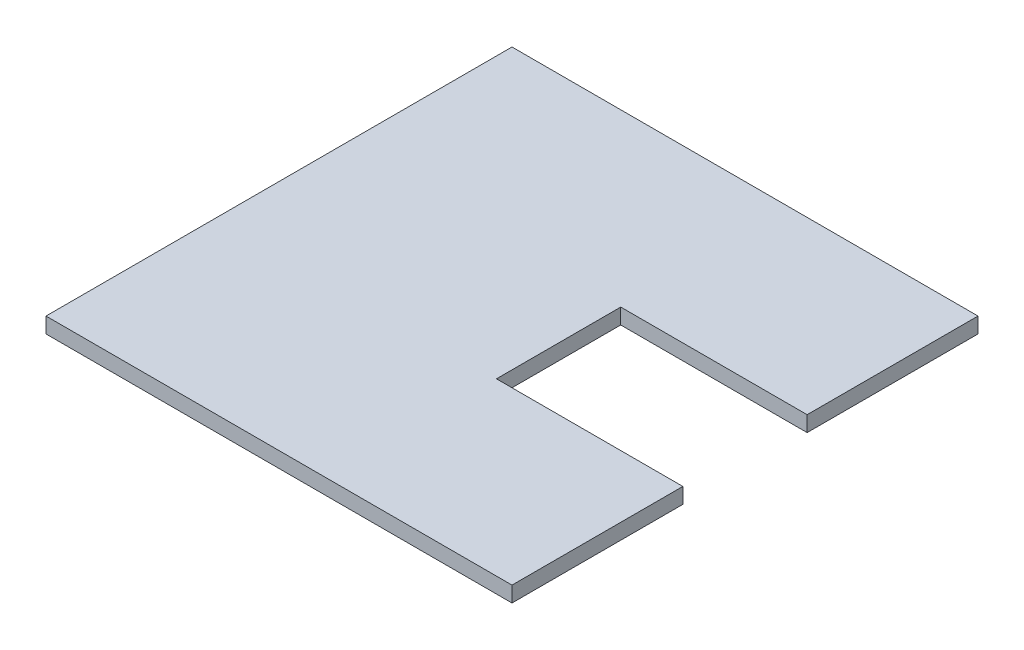
ISO-10303-21;
HEADER;
FILE_DESCRIPTION(('STEP AP214'),'2;1');
FILE_NAME('part.step','',(''),(''),'','','');
FILE_SCHEMA(('AUTOMOTIVE_DESIGN { 1 0 10303 214 1 1 1 1 }'));
ENDSEC;
DATA;
#1=APPLICATION_CONTEXT('core data for automotive mechanical design processes');
#2=APPLICATION_PROTOCOL_DEFINITION('international standard','automotive_design',2000,#1);
#3=PRODUCT_CONTEXT('',#1,'mechanical');
#4=PRODUCT('Part','Part','',(#3));
#5=PRODUCT_RELATED_PRODUCT_CATEGORY('part','',(#4));
#6=PRODUCT_DEFINITION_FORMATION('','',#4);
#7=PRODUCT_DEFINITION_CONTEXT('part definition',#1,'design');
#8=PRODUCT_DEFINITION('design','',#6,#7);
#9=PRODUCT_DEFINITION_SHAPE('','',#8);
#10=(LENGTH_UNIT() NAMED_UNIT(*) SI_UNIT(.MILLI.,.METRE.));
#11=(NAMED_UNIT(*) PLANE_ANGLE_UNIT() SI_UNIT($,.RADIAN.));
#12=(NAMED_UNIT(*) SI_UNIT($,.STERADIAN.) SOLID_ANGLE_UNIT());
#13=UNCERTAINTY_MEASURE_WITH_UNIT(LENGTH_MEASURE(1.E-05),#10,'distance_accuracy_value','');
#14=(GEOMETRIC_REPRESENTATION_CONTEXT(3) GLOBAL_UNCERTAINTY_ASSIGNED_CONTEXT((#13)) GLOBAL_UNIT_ASSIGNED_CONTEXT((#10,
#11,#12)) REPRESENTATION_CONTEXT('',''));
#15=CARTESIAN_POINT('',(0.,0.,0.));
#16=DIRECTION('',(0.,0.,1.));
#17=DIRECTION('',(1.,0.,0.));
#18=AXIS2_PLACEMENT_3D('',#15,#16,#17);
#19=CARTESIAN_POINT('',(74.1892359339113,5.,0.));
#20=DIRECTION('',(-1.,0.,0.));
#21=DIRECTION('',(0.,0.,1.));
#22=AXIS2_PLACEMENT_3D('',#19,#20,#21);
#23=PLANE('',#22);
#24=DIRECTION('',(0.,0.,-1.));
#25=VECTOR('',#24,1.);
#26=CARTESIAN_POINT('',(74.1892359339113,0.,0.));
#27=LINE('',#26,#25);
#28=CARTESIAN_POINT('',(74.1892359339113,0.,-70.7573122464783));
#29=VERTEX_POINT('',#28);
#30=CARTESIAN_POINT('',(74.1892359339113,0.,-110.757312246478));
#31=VERTEX_POINT('',#30);
#32=EDGE_CURVE('E130',#29,#31,#27,.T.);
#33=ORIENTED_EDGE('',*,*,#32,.T.);
#34=DIRECTION('',(0.,-1.,0.));
#35=VECTOR('',#34,1.);
#36=CARTESIAN_POINT('',(74.1892359339113,5.,-110.757312246478));
#37=LINE('',#36,#35);
#38=CARTESIAN_POINT('',(74.1892359339113,5.,-110.757312246478));
#39=VERTEX_POINT('',#38);
#40=EDGE_CURVE('E11',#39,#31,#37,.T.);
#41=ORIENTED_EDGE('',*,*,#40,.F.);
#42=DIRECTION('',(0.,0.,-1.));
#43=VECTOR('',#42,1.);
#44=CARTESIAN_POINT('',(74.1892359339113,5.,0.));
#45=LINE('',#44,#43);
#46=CARTESIAN_POINT('',(74.1892359339113,5.,-70.7573122464783));
#47=VERTEX_POINT('',#46);
#48=EDGE_CURVE('E91',#47,#39,#45,.T.);
#49=ORIENTED_EDGE('',*,*,#48,.F.);
#50=DIRECTION('',(0.,-1.,0.));
#51=VECTOR('',#50,1.);
#52=CARTESIAN_POINT('',(74.1892359339113,5.,-70.7573122464783));
#53=LINE('',#52,#51);
#54=EDGE_CURVE('E126',#47,#29,#53,.T.);
#55=ORIENTED_EDGE('',*,*,#54,.T.);
#56=EDGE_LOOP('',(#33,#41,#49,#55));
#57=FACE_BOUND('',#56,.T.);
#58=ADVANCED_FACE('F35',(#57),#23,.F.);
#59=CARTESIAN_POINT('',(0.,5.,-110.757312246478));
#60=DIRECTION('',(0.,0.,1.));
#61=DIRECTION('',(1.,0.,0.));
#62=AXIS2_PLACEMENT_3D('',#59,#60,#61);
#63=PLANE('',#62);
#64=DIRECTION('',(-1.,0.,0.));
#65=VECTOR('',#64,1.);
#66=CARTESIAN_POINT('',(0.,0.,-110.757312246478));
#67=LINE('',#66,#65);
#68=CARTESIAN_POINT('',(134.189235933911,0.,-110.757312246478));
#69=VERTEX_POINT('',#68);
#70=EDGE_CURVE('E133',#69,#31,#67,.T.);
#71=ORIENTED_EDGE('',*,*,#70,.F.);
#72=DIRECTION('',(0.,-1.,0.));
#73=VECTOR('',#72,1.);
#74=CARTESIAN_POINT('',(134.189235933911,5.,-110.757312246478));
#75=LINE('',#74,#73);
#76=CARTESIAN_POINT('',(134.189235933911,5.,-110.757312246478));
#77=VERTEX_POINT('',#76);
#78=EDGE_CURVE('E43',#77,#69,#75,.T.);
#79=ORIENTED_EDGE('',*,*,#78,.F.);
#80=DIRECTION('',(-1.,0.,0.));
#81=VECTOR('',#80,1.);
#82=CARTESIAN_POINT('',(0.,5.,-110.757312246478));
#83=LINE('',#82,#81);
#84=EDGE_CURVE('E168',#77,#39,#83,.T.);
#85=ORIENTED_EDGE('',*,*,#84,.T.);
#86=ORIENTED_EDGE('',*,*,#40,.T.);
#87=EDGE_LOOP('',(#71,#79,#85,#86));
#88=FACE_BOUND('',#87,.T.);
#89=ADVANCED_FACE('F167',(#88),#63,.T.);
#90=CARTESIAN_POINT('',(134.189235933911,5.,0.));
#91=DIRECTION('',(-1.,0.,0.));
#92=DIRECTION('',(0.,0.,1.));
#93=AXIS2_PLACEMENT_3D('',#90,#91,#92);
#94=PLANE('',#93);
#95=DIRECTION('',(0.,0.,-1.));
#96=VECTOR('',#95,1.);
#97=CARTESIAN_POINT('',(134.189235933911,0.,0.));
#98=LINE('',#97,#96);
#99=CARTESIAN_POINT('',(134.189235933911,0.,-165.757312246478));
#100=VERTEX_POINT('',#99);
#101=EDGE_CURVE('E136',#69,#100,#98,.T.);
#102=ORIENTED_EDGE('',*,*,#101,.T.);
#103=DIRECTION('',(0.,-1.,0.));
#104=VECTOR('',#103,1.);
#105=CARTESIAN_POINT('',(134.189235933911,5.,-165.757312246478));
#106=LINE('',#105,#104);
#107=CARTESIAN_POINT('',(134.189235933911,5.,-165.757312246478));
#108=VERTEX_POINT('',#107);
#109=EDGE_CURVE('E153',#108,#100,#106,.T.);
#110=ORIENTED_EDGE('',*,*,#109,.F.);
#111=DIRECTION('',(0.,0.,-1.));
#112=VECTOR('',#111,1.);
#113=CARTESIAN_POINT('',(134.189235933911,5.,0.));
#114=LINE('',#113,#112);
#115=EDGE_CURVE('E159',#77,#108,#114,.T.);
#116=ORIENTED_EDGE('',*,*,#115,.F.);
#117=ORIENTED_EDGE('',*,*,#78,.T.);
#118=EDGE_LOOP('',(#102,#110,#116,#117));
#119=FACE_BOUND('',#118,.T.);
#120=ADVANCED_FACE('F157',(#119),#94,.F.);
#121=CARTESIAN_POINT('',(0.,5.,-165.757312246478));
#122=DIRECTION('',(0.,0.,-1.));
#123=DIRECTION('',(-1.,0.,0.));
#124=AXIS2_PLACEMENT_3D('',#121,#122,#123);
#125=PLANE('',#124);
#126=DIRECTION('',(1.,0.,0.));
#127=VECTOR('',#126,1.);
#128=CARTESIAN_POINT('',(0.,0.,-165.757312246478));
#129=LINE('',#128,#127);
#130=CARTESIAN_POINT('',(-15.8107640660887,0.,-165.757312246478));
#131=VERTEX_POINT('',#130);
#132=EDGE_CURVE('E139',#131,#100,#129,.T.);
#133=ORIENTED_EDGE('',*,*,#132,.F.);
#134=DIRECTION('',(0.,-1.,0.));
#135=VECTOR('',#134,1.);
#136=CARTESIAN_POINT('',(-15.8107640660887,5.,-165.757312246478));
#137=LINE('',#136,#135);
#138=CARTESIAN_POINT('',(-15.8107640660887,5.,-165.757312246478));
#139=VERTEX_POINT('',#138);
#140=EDGE_CURVE('E151',#139,#131,#137,.T.);
#141=ORIENTED_EDGE('',*,*,#140,.F.);
#142=DIRECTION('',(1.,0.,0.));
#143=VECTOR('',#142,1.);
#144=CARTESIAN_POINT('',(0.,5.,-165.757312246478));
#145=LINE('',#144,#143);
#146=EDGE_CURVE('E176',#139,#108,#145,.T.);
#147=ORIENTED_EDGE('',*,*,#146,.T.);
#148=ORIENTED_EDGE('',*,*,#109,.T.);
#149=EDGE_LOOP('',(#133,#141,#147,#148));
#150=FACE_BOUND('',#149,.T.);
#151=ADVANCED_FACE('F175',(#150),#125,.T.);
#152=CARTESIAN_POINT('',(-15.8107640660887,5.,0.));
#153=DIRECTION('',(-1.,0.,0.));
#154=DIRECTION('',(0.,0.,1.));
#155=AXIS2_PLACEMENT_3D('',#152,#153,#154);
#156=PLANE('',#155);
#157=DIRECTION('',(0.,0.,-1.));
#158=VECTOR('',#157,1.);
#159=CARTESIAN_POINT('',(-15.8107640660887,0.,0.));
#160=LINE('',#159,#158);
#161=CARTESIAN_POINT('',(-15.8107640660887,0.,-15.7573122464783));
#162=VERTEX_POINT('',#161);
#163=EDGE_CURVE('E142',#162,#131,#160,.T.);
#164=ORIENTED_EDGE('',*,*,#163,.F.);
#165=DIRECTION('',(0.,-1.,0.));
#166=VECTOR('',#165,1.);
#167=CARTESIAN_POINT('',(-15.8107640660887,5.,-15.7573122464783));
#168=LINE('',#167,#166);
#169=CARTESIAN_POINT('',(-15.8107640660887,5.,-15.7573122464783));
#170=VERTEX_POINT('',#169);
#171=EDGE_CURVE('E121',#170,#162,#168,.T.);
#172=ORIENTED_EDGE('',*,*,#171,.F.);
#173=DIRECTION('',(0.,0.,-1.));
#174=VECTOR('',#173,1.);
#175=CARTESIAN_POINT('',(-15.8107640660887,5.,0.));
#176=LINE('',#175,#174);
#177=EDGE_CURVE('E114',#170,#139,#176,.T.);
#178=ORIENTED_EDGE('',*,*,#177,.T.);
#179=ORIENTED_EDGE('',*,*,#140,.T.);
#180=EDGE_LOOP('',(#164,#172,#178,#179));
#181=FACE_BOUND('',#180,.T.);
#182=ADVANCED_FACE('F172',(#181),#156,.T.);
#183=CARTESIAN_POINT('',(0.,5.,-15.7573122464783));
#184=DIRECTION('',(0.,0.,-1.));
#185=DIRECTION('',(-1.,0.,0.));
#186=AXIS2_PLACEMENT_3D('',#183,#184,#185);
#187=PLANE('',#186);
#188=DIRECTION('',(1.,0.,0.));
#189=VECTOR('',#188,1.);
#190=CARTESIAN_POINT('',(0.,0.,-15.7573122464783));
#191=LINE('',#190,#189);
#192=CARTESIAN_POINT('',(134.189235933911,0.,-15.7573122464783));
#193=VERTEX_POINT('',#192);
#194=EDGE_CURVE('E120',#162,#193,#191,.T.);
#195=ORIENTED_EDGE('',*,*,#194,.T.);
#196=DIRECTION('',(0.,-1.,0.));
#197=VECTOR('',#196,1.);
#198=CARTESIAN_POINT('',(134.189235933911,5.,-15.7573122464783));
#199=LINE('',#198,#197);
#200=CARTESIAN_POINT('',(134.189235933911,5.,-15.7573122464783));
#201=VERTEX_POINT('',#200);
#202=EDGE_CURVE('E117',#201,#193,#199,.T.);
#203=ORIENTED_EDGE('',*,*,#202,.F.);
#204=DIRECTION('',(1.,0.,0.));
#205=VECTOR('',#204,1.);
#206=CARTESIAN_POINT('',(0.,5.,-15.7573122464783));
#207=LINE('',#206,#205);
#208=EDGE_CURVE('E107',#170,#201,#207,.T.);
#209=ORIENTED_EDGE('',*,*,#208,.F.);
#210=ORIENTED_EDGE('',*,*,#171,.T.);
#211=EDGE_LOOP('',(#195,#203,#209,#210));
#212=FACE_BOUND('',#211,.T.);
#213=ADVANCED_FACE('F118',(#212),#187,.F.);
#214=CARTESIAN_POINT('',(134.189235933911,5.,0.));
#215=DIRECTION('',(-1.,0.,0.));
#216=DIRECTION('',(0.,0.,1.));
#217=AXIS2_PLACEMENT_3D('',#214,#215,#216);
#218=PLANE('',#217);
#219=DIRECTION('',(0.,0.,-1.));
#220=VECTOR('',#219,1.);
#221=CARTESIAN_POINT('',(134.189235933911,0.,0.));
#222=LINE('',#221,#220);
#223=CARTESIAN_POINT('',(134.189235933911,0.,-70.7573122464783));
#224=VERTEX_POINT('',#223);
#225=EDGE_CURVE('E79',#193,#224,#222,.T.);
#226=ORIENTED_EDGE('',*,*,#225,.T.);
#227=DIRECTION('',(0.,-1.,0.));
#228=VECTOR('',#227,1.);
#229=CARTESIAN_POINT('',(134.189235933911,5.,-70.7573122464783));
#230=LINE('',#229,#228);
#231=CARTESIAN_POINT('',(134.189235933911,5.,-70.7573122464783));
#232=VERTEX_POINT('',#231);
#233=EDGE_CURVE('E122',#232,#224,#230,.T.);
#234=ORIENTED_EDGE('',*,*,#233,.F.);
#235=DIRECTION('',(0.,0.,-1.));
#236=VECTOR('',#235,1.);
#237=CARTESIAN_POINT('',(134.189235933911,5.,0.));
#238=LINE('',#237,#236);
#239=EDGE_CURVE('E111',#201,#232,#238,.T.);
#240=ORIENTED_EDGE('',*,*,#239,.F.);
#241=ORIENTED_EDGE('',*,*,#202,.T.);
#242=EDGE_LOOP('',(#226,#234,#240,#241));
#243=FACE_BOUND('',#242,.T.);
#244=ADVANCED_FACE('F124',(#243),#218,.F.);
#245=CARTESIAN_POINT('',(0.,5.,-70.7573122464783));
#246=DIRECTION('',(0.,0.,1.));
#247=DIRECTION('',(1.,0.,0.));
#248=AXIS2_PLACEMENT_3D('',#245,#246,#247);
#249=PLANE('',#248);
#250=DIRECTION('',(-1.,0.,0.));
#251=VECTOR('',#250,1.);
#252=CARTESIAN_POINT('',(0.,0.,-70.7573122464783));
#253=LINE('',#252,#251);
#254=EDGE_CURVE('E85',#224,#29,#253,.T.);
#255=ORIENTED_EDGE('',*,*,#254,.T.);
#256=ORIENTED_EDGE('',*,*,#54,.F.);
#257=DIRECTION('',(-1.,0.,0.));
#258=VECTOR('',#257,1.);
#259=CARTESIAN_POINT('',(0.,5.,-70.7573122464783));
#260=LINE('',#259,#258);
#261=EDGE_CURVE('E51',#232,#47,#260,.T.);
#262=ORIENTED_EDGE('',*,*,#261,.F.);
#263=ORIENTED_EDGE('',*,*,#233,.T.);
#264=EDGE_LOOP('',(#255,#256,#262,#263));
#265=FACE_BOUND('',#264,.T.);
#266=ADVANCED_FACE('F226',(#265),#249,.F.);
#267=CARTESIAN_POINT('',(0.,5.,0.));
#268=DIRECTION('',(0.,1.,0.));
#269=DIRECTION('',(0.,0.,1.));
#270=AXIS2_PLACEMENT_3D('',#267,#268,#269);
#271=PLANE('',#270);
#272=ORIENTED_EDGE('',*,*,#48,.T.);
#273=ORIENTED_EDGE('',*,*,#84,.F.);
#274=ORIENTED_EDGE('',*,*,#115,.T.);
#275=ORIENTED_EDGE('',*,*,#146,.F.);
#276=ORIENTED_EDGE('',*,*,#177,.F.);
#277=ORIENTED_EDGE('',*,*,#208,.T.);
#278=ORIENTED_EDGE('',*,*,#239,.T.);
#279=ORIENTED_EDGE('',*,*,#261,.T.);
#280=EDGE_LOOP('',(#272,#273,#274,#275,#276,#277,#278,#279));
#281=FACE_BOUND('',#280,.T.);
#282=ADVANCED_FACE('F109',(#281),#271,.T.);
#283=CARTESIAN_POINT('',(0.,0.,0.));
#284=DIRECTION('',(0.,1.,0.));
#285=DIRECTION('',(0.,0.,1.));
#286=AXIS2_PLACEMENT_3D('',#283,#284,#285);
#287=PLANE('',#286);
#288=ORIENTED_EDGE('',*,*,#32,.F.);
#289=ORIENTED_EDGE('',*,*,#254,.F.);
#290=ORIENTED_EDGE('',*,*,#225,.F.);
#291=ORIENTED_EDGE('',*,*,#194,.F.);
#292=ORIENTED_EDGE('',*,*,#163,.T.);
#293=ORIENTED_EDGE('',*,*,#132,.T.);
#294=ORIENTED_EDGE('',*,*,#101,.F.);
#295=ORIENTED_EDGE('',*,*,#70,.T.);
#296=EDGE_LOOP('',(#288,#289,#290,#291,#292,#293,#294,#295));
#297=FACE_BOUND('',#296,.T.);
#298=ADVANCED_FACE('F165',(#297),#287,.F.);
#299=CLOSED_SHELL('',(#58,#89,#120,#151,#182,#213,#244,#266,#282,#298));
#300=MANIFOLD_SOLID_BREP('B2',#299);
#301=ADVANCED_BREP_SHAPE_REPRESENTATION('',(#18,#300),#14);
#302=SHAPE_DEFINITION_REPRESENTATION(#9,#301);
ENDSEC;
END-ISO-10303-21;
